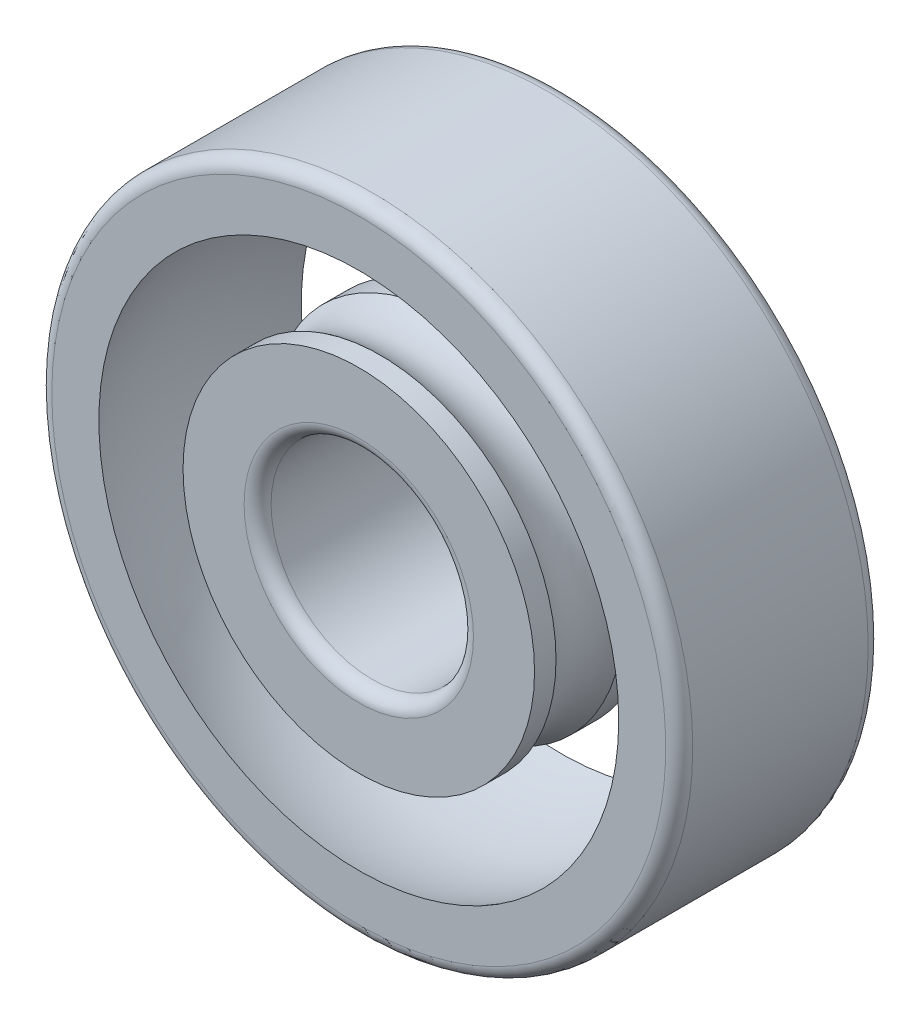
ISO-10303-21;
HEADER;
FILE_DESCRIPTION(('STEP AP214'),'2;1');
FILE_NAME('part.step','',(''),(''),'','','');
FILE_SCHEMA(('AUTOMOTIVE_DESIGN { 1 0 10303 214 1 1 1 1 }'));
ENDSEC;
DATA;
#1=APPLICATION_CONTEXT('core data for automotive mechanical design processes');
#2=APPLICATION_PROTOCOL_DEFINITION('international standard','automotive_design',2000,#1);
#3=PRODUCT_CONTEXT('',#1,'mechanical');
#4=PRODUCT('Part','Part','',(#3));
#5=PRODUCT_RELATED_PRODUCT_CATEGORY('part','',(#4));
#6=PRODUCT_DEFINITION_FORMATION('','',#4);
#7=PRODUCT_DEFINITION_CONTEXT('part definition',#1,'design');
#8=PRODUCT_DEFINITION('design','',#6,#7);
#9=PRODUCT_DEFINITION_SHAPE('','',#8);
#10=(LENGTH_UNIT() NAMED_UNIT(*) SI_UNIT(.MILLI.,.METRE.));
#11=(NAMED_UNIT(*) PLANE_ANGLE_UNIT() SI_UNIT($,.RADIAN.));
#12=(NAMED_UNIT(*) SI_UNIT($,.STERADIAN.) SOLID_ANGLE_UNIT());
#13=UNCERTAINTY_MEASURE_WITH_UNIT(LENGTH_MEASURE(1.E-05),#10,'distance_accuracy_value','');
#14=(GEOMETRIC_REPRESENTATION_CONTEXT(3) GLOBAL_UNCERTAINTY_ASSIGNED_CONTEXT((#13)) GLOBAL_UNIT_ASSIGNED_CONTEXT((#10,
#11,#12)) REPRESENTATION_CONTEXT('',''));
#15=CARTESIAN_POINT('',(0.,0.,0.));
#16=DIRECTION('',(0.,0.,1.));
#17=DIRECTION('',(1.,0.,0.));
#18=AXIS2_PLACEMENT_3D('',#15,#16,#17);
#19=CARTESIAN_POINT('',(0.,5.20999999999996,-6.00000000000001));
#20=DIRECTION('',(0.,0.,0.999999999999967));
#21=DIRECTION('',(0.999999999999967,0.,0.));
#22=AXIS2_PLACEMENT_3D('',#19,#20,#21);
#23=PLANE('',#22);
#24=CARTESIAN_POINT('',(0.,0.,-6.00000000000001));
#25=DIRECTION('',(0.,0.,0.999999999999967));
#26=DIRECTION('',(0.999999999999967,0.,0.));
#27=AXIS2_PLACEMENT_3D('',#24,#25,#26);
#28=CIRCLE('',#27,3.4);
#29=CARTESIAN_POINT('',(3.39999999999989,0.,-6.00000000000001));
#30=VERTEX_POINT('',#29);
#31=EDGE_CURVE('E13',#30,#30,#28,.T.);
#32=ORIENTED_EDGE('',*,*,#31,.T.);
#33=EDGE_LOOP('',(#32));
#34=FACE_BOUND('',#33,.T.);
#35=CARTESIAN_POINT('',(0.,0.,-6.00000000000001));
#36=DIRECTION('',(0.,0.,0.999999999999967));
#37=DIRECTION('',(0.999999999999967,0.,0.));
#38=AXIS2_PLACEMENT_3D('',#35,#36,#37);
#39=CIRCLE('',#38,5.21);
#40=CARTESIAN_POINT('',(5.20999999999983,0.,-6.00000000000001));
#41=VERTEX_POINT('',#40);
#42=EDGE_CURVE('E76',#41,#41,#39,.T.);
#43=ORIENTED_EDGE('',*,*,#42,.F.);
#44=EDGE_LOOP('',(#43));
#45=FACE_BOUND('',#44,.T.);
#46=ADVANCED_FACE('F56',(#34,#45),#23,.F.);
#47=CARTESIAN_POINT('',(0.,0.,0.));
#48=DIRECTION('',(0.,0.,0.999999999999967));
#49=DIRECTION('',(0.999999999999967,0.,0.));
#50=AXIS2_PLACEMENT_3D('',#47,#48,#49);
#51=CYLINDRICAL_SURFACE('',#50,5.21);
#52=CARTESIAN_POINT('',(0.,0.,-5.36319279495451));
#53=DIRECTION('',(0.,0.,0.999999999999967));
#54=DIRECTION('',(0.999999999999967,0.,0.));
#55=AXIS2_PLACEMENT_3D('',#52,#53,#54);
#56=CIRCLE('',#55,5.21);
#57=CARTESIAN_POINT('',(5.20999999999983,0.,-5.36319279495451));
#58=VERTEX_POINT('',#57);
#59=EDGE_CURVE('E79',#58,#58,#56,.T.);
#60=ORIENTED_EDGE('',*,*,#59,.F.);
#61=EDGE_LOOP('',(#60));
#62=FACE_BOUND('',#61,.T.);
#63=ORIENTED_EDGE('',*,*,#42,.T.);
#64=EDGE_LOOP('',(#63));
#65=FACE_BOUND('',#64,.T.);
#66=ADVANCED_FACE('F118',(#62,#65),#51,.T.);
#67=CARTESIAN_POINT('',(0.,0.,-4.375));
#68=DIRECTION('',(0.,0.,0.999999999999967));
#69=DIRECTION('',(0.999999999999967,0.,0.));
#70=AXIS2_PLACEMENT_3D('',#67,#68,#69);
#71=TOROIDAL_SURFACE('',#70,6.5,1.625);
#72=CARTESIAN_POINT('',(0.,0.,-3.38680720504549));
#73=DIRECTION('',(0.,0.,0.999999999999967));
#74=DIRECTION('',(0.999999999999967,0.,0.));
#75=AXIS2_PLACEMENT_3D('',#72,#73,#74);
#76=CIRCLE('',#75,5.21);
#77=CARTESIAN_POINT('',(5.20999999999983,0.,-3.38680720504549));
#78=VERTEX_POINT('',#77);
#79=EDGE_CURVE('E82',#78,#78,#76,.T.);
#80=ORIENTED_EDGE('',*,*,#79,.F.);
#81=EDGE_LOOP('',(#80));
#82=FACE_BOUND('',#81,.T.);
#83=ORIENTED_EDGE('',*,*,#59,.T.);
#84=EDGE_LOOP('',(#83));
#85=FACE_BOUND('',#84,.T.);
#86=ADVANCED_FACE('F112',(#82,#85),#71,.F.);
#87=CARTESIAN_POINT('',(0.,0.,0.));
#88=DIRECTION('',(0.,0.,0.999999999999967));
#89=DIRECTION('',(0.999999999999967,0.,0.));
#90=AXIS2_PLACEMENT_3D('',#87,#88,#89);
#91=CYLINDRICAL_SURFACE('',#90,5.21);
#92=CARTESIAN_POINT('',(0.,0.,-2.61319279495451));
#93=DIRECTION('',(0.,0.,0.999999999999967));
#94=DIRECTION('',(0.999999999999967,0.,0.));
#95=AXIS2_PLACEMENT_3D('',#92,#93,#94);
#96=CIRCLE('',#95,5.21);
#97=CARTESIAN_POINT('',(5.20999999999983,0.,-2.61319279495451));
#98=VERTEX_POINT('',#97);
#99=EDGE_CURVE('E85',#98,#98,#96,.T.);
#100=ORIENTED_EDGE('',*,*,#99,.F.);
#101=EDGE_LOOP('',(#100));
#102=FACE_BOUND('',#101,.T.);
#103=ORIENTED_EDGE('',*,*,#79,.T.);
#104=EDGE_LOOP('',(#103));
#105=FACE_BOUND('',#104,.T.);
#106=ADVANCED_FACE('F106',(#102,#105),#91,.T.);
#107=CARTESIAN_POINT('',(0.,0.,-1.625));
#108=DIRECTION('',(0.,0.,0.999999999999967));
#109=DIRECTION('',(0.999999999999967,0.,0.));
#110=AXIS2_PLACEMENT_3D('',#107,#108,#109);
#111=TOROIDAL_SURFACE('',#110,6.5,1.625);
#112=CARTESIAN_POINT('',(0.,0.,-0.636807205045498));
#113=DIRECTION('',(0.,0.,0.999999999999967));
#114=DIRECTION('',(0.999999999999967,0.,0.));
#115=AXIS2_PLACEMENT_3D('',#112,#113,#114);
#116=CIRCLE('',#115,5.21);
#117=CARTESIAN_POINT('',(5.20999999999983,0.,-0.636807205045498));
#118=VERTEX_POINT('',#117);
#119=EDGE_CURVE('E88',#118,#118,#116,.T.);
#120=ORIENTED_EDGE('',*,*,#119,.F.);
#121=EDGE_LOOP('',(#120));
#122=FACE_BOUND('',#121,.T.);
#123=ORIENTED_EDGE('',*,*,#99,.T.);
#124=EDGE_LOOP('',(#123));
#125=FACE_BOUND('',#124,.T.);
#126=ADVANCED_FACE('F100',(#122,#125),#111,.F.);
#127=CARTESIAN_POINT('',(0.,0.,0.));
#128=DIRECTION('',(0.,0.,0.999999999999967));
#129=DIRECTION('',(0.999999999999967,0.,0.));
#130=AXIS2_PLACEMENT_3D('',#127,#128,#129);
#131=CYLINDRICAL_SURFACE('',#130,5.21);
#132=CARTESIAN_POINT('',(0.,0.,0.));
#133=DIRECTION('',(0.,0.,0.999999999999967));
#134=DIRECTION('',(0.999999999999967,0.,0.));
#135=AXIS2_PLACEMENT_3D('',#132,#133,#134);
#136=CIRCLE('',#135,5.21);
#137=CARTESIAN_POINT('',(5.20999999999983,0.,0.));
#138=VERTEX_POINT('',#137);
#139=EDGE_CURVE('E91',#138,#138,#136,.T.);
#140=ORIENTED_EDGE('',*,*,#139,.F.);
#141=EDGE_LOOP('',(#140));
#142=FACE_BOUND('',#141,.T.);
#143=ORIENTED_EDGE('',*,*,#119,.T.);
#144=EDGE_LOOP('',(#143));
#145=FACE_BOUND('',#144,.T.);
#146=ADVANCED_FACE('F97',(#142,#145),#131,.T.);
#147=CARTESIAN_POINT('',(0.,5.20999999999996,0.));
#148=DIRECTION('',(0.,0.,-0.999999999999967));
#149=DIRECTION('',(-0.999999999999967,0.,0.));
#150=AXIS2_PLACEMENT_3D('',#147,#148,#149);
#151=PLANE('',#150);
#152=CARTESIAN_POINT('',(0.,0.,0.));
#153=DIRECTION('',(0.,0.,-0.999999999999967));
#154=DIRECTION('',(-0.999999999999967,0.,0.));
#155=AXIS2_PLACEMENT_3D('',#152,#153,#154);
#156=CIRCLE('',#155,3.4);
#157=CARTESIAN_POINT('',(-3.39999999999989,0.,0.));
#158=VERTEX_POINT('',#157);
#159=EDGE_CURVE('E63',#158,#158,#156,.T.);
#160=ORIENTED_EDGE('',*,*,#159,.T.);
#161=EDGE_LOOP('',(#160));
#162=FACE_BOUND('',#161,.T.);
#163=ORIENTED_EDGE('',*,*,#139,.T.);
#164=EDGE_LOOP('',(#163));
#165=FACE_BOUND('',#164,.T.);
#166=ADVANCED_FACE('F95',(#162,#165),#151,.F.);
#167=CARTESIAN_POINT('',(0.,0.,0.));
#168=DIRECTION('',(0.,0.,0.999999999999967));
#169=DIRECTION('',(0.999999999999967,0.,0.));
#170=AXIS2_PLACEMENT_3D('',#167,#168,#169);
#171=CYLINDRICAL_SURFACE('',#170,3.);
#172=CARTESIAN_POINT('',(0.,0.,-0.399999999999998));
#173=DIRECTION('',(0.,0.,-0.999999999999967));
#174=DIRECTION('',(-0.999999999999967,0.,0.));
#175=AXIS2_PLACEMENT_3D('',#172,#173,#174);
#176=CIRCLE('',#175,3.);
#177=CARTESIAN_POINT('',(-2.9999999999999,0.,-0.399999999999998));
#178=VERTEX_POINT('',#177);
#179=EDGE_CURVE('E67',#178,#178,#176,.F.);
#180=ORIENTED_EDGE('',*,*,#179,.T.);
#181=EDGE_LOOP('',(#180));
#182=FACE_BOUND('',#181,.T.);
#183=CARTESIAN_POINT('',(0.,0.,-5.59999999999999));
#184=DIRECTION('',(0.,0.,0.999999999999967));
#185=DIRECTION('',(0.999999999999967,0.,0.));
#186=AXIS2_PLACEMENT_3D('',#183,#184,#185);
#187=CIRCLE('',#186,3.);
#188=CARTESIAN_POINT('',(2.9999999999999,0.,-5.59999999999999));
#189=VERTEX_POINT('',#188);
#190=EDGE_CURVE('E71',#189,#189,#187,.F.);
#191=ORIENTED_EDGE('',*,*,#190,.T.);
#192=EDGE_LOOP('',(#191));
#193=FACE_BOUND('',#192,.T.);
#194=ADVANCED_FACE('F133',(#182,#193),#171,.F.);
#195=CARTESIAN_POINT('',(0.,0.,-0.399999999999998));
#196=DIRECTION('',(0.,0.,-0.999999999999967));
#197=DIRECTION('',(-0.999999999999967,0.,0.));
#198=AXIS2_PLACEMENT_3D('',#195,#196,#197);
#199=TOROIDAL_SURFACE('',#198,3.4,0.4);
#200=ORIENTED_EDGE('',*,*,#159,.F.);
#201=EDGE_LOOP('',(#200));
#202=FACE_BOUND('',#201,.T.);
#203=ORIENTED_EDGE('',*,*,#179,.F.);
#204=EDGE_LOOP('',(#203));
#205=FACE_BOUND('',#204,.T.);
#206=ADVANCED_FACE('F131',(#202,#205),#199,.T.);
#207=CARTESIAN_POINT('',(0.,0.,-5.59999999999999));
#208=DIRECTION('',(0.,0.,0.999999999999967));
#209=DIRECTION('',(0.999999999999967,0.,0.));
#210=AXIS2_PLACEMENT_3D('',#207,#208,#209);
#211=TOROIDAL_SURFACE('',#210,3.4,0.4);
#212=ORIENTED_EDGE('',*,*,#190,.F.);
#213=EDGE_LOOP('',(#212));
#214=FACE_BOUND('',#213,.T.);
#215=ORIENTED_EDGE('',*,*,#31,.F.);
#216=EDGE_LOOP('',(#215));
#217=FACE_BOUND('',#216,.T.);
#218=ADVANCED_FACE('F58',(#214,#217),#211,.T.);
#219=CLOSED_SHELL('',(#46,#66,#86,#106,#126,#146,#166,#194,#206,#218));
#220=MANIFOLD_SOLID_BREP('B2',#219);
#221=CARTESIAN_POINT('',(0.,9.49999999999996,0.));
#222=DIRECTION('',(0.,0.,-0.999999999999967));
#223=DIRECTION('',(-0.999999999999967,0.,0.));
#224=AXIS2_PLACEMENT_3D('',#221,#222,#223);
#225=PLANE('',#224);
#226=CARTESIAN_POINT('',(0.,0.,0.));
#227=DIRECTION('',(0.,0.,-0.999999999999967));
#228=DIRECTION('',(-0.999999999999967,0.,0.));
#229=AXIS2_PLACEMENT_3D('',#226,#227,#228);
#230=CIRCLE('',#229,9.1);
#231=CARTESIAN_POINT('',(-9.0999999999997,0.,0.));
#232=VERTEX_POINT('',#231);
#233=EDGE_CURVE('E55',#232,#232,#230,.F.);
#234=ORIENTED_EDGE('',*,*,#233,.T.);
#235=EDGE_LOOP('',(#234));
#236=FACE_BOUND('',#235,.T.);
#237=CARTESIAN_POINT('',(0.,0.,0.));
#238=DIRECTION('',(0.,0.,0.999999999999967));
#239=DIRECTION('',(0.999999999999967,0.,0.));
#240=AXIS2_PLACEMENT_3D('',#237,#238,#239);
#241=CIRCLE('',#240,7.70543533371848);
#242=CARTESIAN_POINT('',(7.70543533371822,0.,0.));
#243=VERTEX_POINT('',#242);
#244=EDGE_CURVE('E213',#243,#243,#241,.T.);
#245=ORIENTED_EDGE('',*,*,#244,.F.);
#246=EDGE_LOOP('',(#245));
#247=FACE_BOUND('',#246,.T.);
#248=ADVANCED_FACE('F193',(#236,#247),#225,.F.);
#249=CARTESIAN_POINT('',(0.,0.,-3.));
#250=DIRECTION('',(0.,0.,0.999999999999967));
#251=DIRECTION('',(0.,1.,0.));
#252=AXIS2_PLACEMENT_3D('',#249,#250,#251);
#253=SPHERICAL_SURFACE('',#252,8.26884113295915);
#254=CARTESIAN_POINT('',(0.,0.,-5.99999999999999));
#255=DIRECTION('',(0.,0.,0.999999999999967));
#256=DIRECTION('',(0.999999999999967,0.,0.));
#257=AXIS2_PLACEMENT_3D('',#254,#255,#256);
#258=CIRCLE('',#257,7.70543533371848);
#259=CARTESIAN_POINT('',(7.70543533371823,0.,-5.99999999999999));
#260=VERTEX_POINT('',#259);
#261=EDGE_CURVE('E216',#260,#260,#258,.T.);
#262=ORIENTED_EDGE('',*,*,#261,.F.);
#263=EDGE_LOOP('',(#262));
#264=FACE_BOUND('',#263,.T.);
#265=ORIENTED_EDGE('',*,*,#244,.T.);
#266=EDGE_LOOP('',(#265));
#267=FACE_BOUND('',#266,.T.);
#268=ADVANCED_FACE('F222',(#264,#267),#253,.F.);
#269=CARTESIAN_POINT('',(0.,9.49999999999996,-6.00000000000001));
#270=DIRECTION('',(0.,0.,0.999999999999967));
#271=DIRECTION('',(0.999999999999967,0.,0.));
#272=AXIS2_PLACEMENT_3D('',#269,#270,#271);
#273=PLANE('',#272);
#274=CARTESIAN_POINT('',(0.,0.,-6.00000000000001));
#275=DIRECTION('',(0.,0.,0.999999999999967));
#276=DIRECTION('',(0.999999999999967,0.,0.));
#277=AXIS2_PLACEMENT_3D('',#274,#275,#276);
#278=CIRCLE('',#277,9.1);
#279=CARTESIAN_POINT('',(9.0999999999997,0.,-6.00000000000001));
#280=VERTEX_POINT('',#279);
#281=EDGE_CURVE('E200',#280,#280,#278,.F.);
#282=ORIENTED_EDGE('',*,*,#281,.T.);
#283=EDGE_LOOP('',(#282));
#284=FACE_BOUND('',#283,.T.);
#285=ORIENTED_EDGE('',*,*,#261,.T.);
#286=EDGE_LOOP('',(#285));
#287=FACE_BOUND('',#286,.T.);
#288=ADVANCED_FACE('F220',(#284,#287),#273,.F.);
#289=CARTESIAN_POINT('',(0.,0.,0.));
#290=DIRECTION('',(0.,0.,0.999999999999967));
#291=DIRECTION('',(0.999999999999967,0.,0.));
#292=AXIS2_PLACEMENT_3D('',#289,#290,#291);
#293=CYLINDRICAL_SURFACE('',#292,9.5);
#294=CARTESIAN_POINT('',(0.,0.,-5.59999999999999));
#295=DIRECTION('',(0.,0.,0.999999999999967));
#296=DIRECTION('',(0.999999999999967,0.,0.));
#297=AXIS2_PLACEMENT_3D('',#294,#295,#296);
#298=CIRCLE('',#297,9.5);
#299=CARTESIAN_POINT('',(9.49999999999968,0.,-5.59999999999999));
#300=VERTEX_POINT('',#299);
#301=EDGE_CURVE('E204',#300,#300,#298,.T.);
#302=ORIENTED_EDGE('',*,*,#301,.T.);
#303=EDGE_LOOP('',(#302));
#304=FACE_BOUND('',#303,.T.);
#305=CARTESIAN_POINT('',(0.,0.,-0.399999999999998));
#306=DIRECTION('',(0.,0.,-0.999999999999967));
#307=DIRECTION('',(-0.999999999999967,0.,0.));
#308=AXIS2_PLACEMENT_3D('',#305,#306,#307);
#309=CIRCLE('',#308,9.5);
#310=CARTESIAN_POINT('',(-9.49999999999968,0.,-0.399999999999998));
#311=VERTEX_POINT('',#310);
#312=EDGE_CURVE('E208',#311,#311,#309,.T.);
#313=ORIENTED_EDGE('',*,*,#312,.T.);
#314=EDGE_LOOP('',(#313));
#315=FACE_BOUND('',#314,.T.);
#316=ADVANCED_FACE('F235',(#304,#315),#293,.T.);
#317=CARTESIAN_POINT('',(0.,0.,-5.59999999999999));
#318=DIRECTION('',(0.,0.,0.999999999999967));
#319=DIRECTION('',(0.999999999999967,0.,0.));
#320=AXIS2_PLACEMENT_3D('',#317,#318,#319);
#321=TOROIDAL_SURFACE('',#320,9.1,0.4);
#322=ORIENTED_EDGE('',*,*,#281,.F.);
#323=EDGE_LOOP('',(#322));
#324=FACE_BOUND('',#323,.T.);
#325=ORIENTED_EDGE('',*,*,#301,.F.);
#326=EDGE_LOOP('',(#325));
#327=FACE_BOUND('',#326,.T.);
#328=ADVANCED_FACE('F233',(#324,#327),#321,.T.);
#329=CARTESIAN_POINT('',(0.,0.,-0.399999999999998));
#330=DIRECTION('',(0.,0.,-0.999999999999967));
#331=DIRECTION('',(-0.999999999999967,0.,0.));
#332=AXIS2_PLACEMENT_3D('',#329,#330,#331);
#333=TOROIDAL_SURFACE('',#332,9.1,0.4);
#334=ORIENTED_EDGE('',*,*,#312,.F.);
#335=EDGE_LOOP('',(#334));
#336=FACE_BOUND('',#335,.T.);
#337=ORIENTED_EDGE('',*,*,#233,.F.);
#338=EDGE_LOOP('',(#337));
#339=FACE_BOUND('',#338,.T.);
#340=ADVANCED_FACE('F195',(#336,#339),#333,.T.);
#341=CLOSED_SHELL('',(#248,#268,#288,#316,#328,#340));
#342=MANIFOLD_SOLID_BREP('B8',#341);
#343=ADVANCED_BREP_SHAPE_REPRESENTATION('',(#18,#220,#342),#14);
#344=SHAPE_DEFINITION_REPRESENTATION(#9,#343);
ENDSEC;
END-ISO-10303-21;
